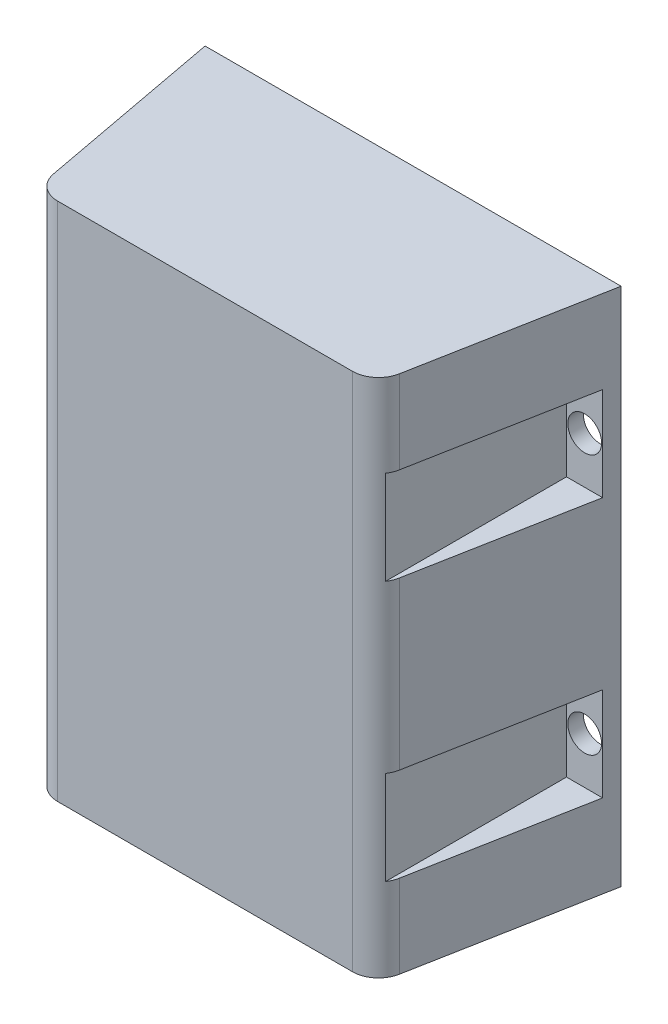
ISO-10303-21;
HEADER;
FILE_DESCRIPTION(('STEP AP214'),'2;1');
FILE_NAME('part.step','',(''),(''),'','','');
FILE_SCHEMA(('AUTOMOTIVE_DESIGN { 1 0 10303 214 1 1 1 1 }'));
ENDSEC;
DATA;
#1=APPLICATION_CONTEXT('core data for automotive mechanical design processes');
#2=APPLICATION_PROTOCOL_DEFINITION('international standard','automotive_design',2000,#1);
#3=PRODUCT_CONTEXT('',#1,'mechanical');
#4=PRODUCT('Part','Part','',(#3));
#5=PRODUCT_RELATED_PRODUCT_CATEGORY('part','',(#4));
#6=PRODUCT_DEFINITION_FORMATION('','',#4);
#7=PRODUCT_DEFINITION_CONTEXT('part definition',#1,'design');
#8=PRODUCT_DEFINITION('design','',#6,#7);
#9=PRODUCT_DEFINITION_SHAPE('','',#8);
#10=(LENGTH_UNIT() NAMED_UNIT(*) SI_UNIT(.MILLI.,.METRE.));
#11=(NAMED_UNIT(*) PLANE_ANGLE_UNIT() SI_UNIT($,.RADIAN.));
#12=(NAMED_UNIT(*) SI_UNIT($,.STERADIAN.) SOLID_ANGLE_UNIT());
#13=UNCERTAINTY_MEASURE_WITH_UNIT(LENGTH_MEASURE(1.E-05),#10,'distance_accuracy_value','');
#14=(GEOMETRIC_REPRESENTATION_CONTEXT(3) GLOBAL_UNCERTAINTY_ASSIGNED_CONTEXT((#13)) GLOBAL_UNIT_ASSIGNED_CONTEXT((#10,
#11,#12)) REPRESENTATION_CONTEXT('',''));
#15=CARTESIAN_POINT('',(0.,0.,0.));
#16=DIRECTION('',(0.,0.,1.));
#17=DIRECTION('',(1.,0.,0.));
#18=AXIS2_PLACEMENT_3D('',#15,#16,#17);
#19=CARTESIAN_POINT('',(-40.,50.,40.));
#20=DIRECTION('',(0.,-1.,0.));
#21=DIRECTION('',(0.,0.,-1.));
#22=AXIS2_PLACEMENT_3D('',#19,#20,#21);
#23=PLANE('',#22);
#24=CARTESIAN_POINT('',(28.3503685637188,50.,35.));
#25=DIRECTION('',(0.,-1.,0.));
#26=DIRECTION('',(0.,0.,-1.));
#27=AXIS2_PLACEMENT_3D('',#24,#25,#26);
#28=CIRCLE('',#27,5.);
#29=CARTESIAN_POINT('',(33.2647294983905,50.,35.9214426752509));
#30=VERTEX_POINT('',#29);
#31=CARTESIAN_POINT('',(28.3503685637188,50.,40.));
#32=VERTEX_POINT('',#31);
#33=EDGE_CURVE('E187',#30,#32,#28,.T.);
#34=ORIENTED_EDGE('',*,*,#33,.F.);
#35=DIRECTION('',(-0.184288535050185,0.,0.982872186934322));
#36=VECTOR('',#35,1.);
#37=CARTESIAN_POINT('',(32.5,50.,40.));
#38=LINE('',#37,#36);
#39=CARTESIAN_POINT('',(40.,50.,0.));
#40=VERTEX_POINT('',#39);
#41=EDGE_CURVE('E316',#40,#30,#38,.T.);
#42=ORIENTED_EDGE('',*,*,#41,.F.);
#43=DIRECTION('',(-1.,0.,0.));
#44=VECTOR('',#43,1.);
#45=CARTESIAN_POINT('',(-40.,50.,0.));
#46=LINE('',#45,#44);
#47=CARTESIAN_POINT('',(-40.,50.,0.));
#48=VERTEX_POINT('',#47);
#49=EDGE_CURVE('E226',#40,#48,#46,.T.);
#50=ORIENTED_EDGE('',*,*,#49,.T.);
#51=DIRECTION('',(-0.184288535050185,0.,-0.982872186934322));
#52=VECTOR('',#51,1.);
#53=CARTESIAN_POINT('',(-32.5,50.,40.));
#54=LINE('',#53,#52);
#55=CARTESIAN_POINT('',(-33.2647294983905,50.,35.9214426752509));
#56=VERTEX_POINT('',#55);
#57=EDGE_CURVE('E312',#56,#48,#54,.T.);
#58=ORIENTED_EDGE('',*,*,#57,.F.);
#59=CARTESIAN_POINT('',(-28.3503685637188,50.,35.));
#60=DIRECTION('',(0.,-1.,0.));
#61=DIRECTION('',(0.,0.,-1.));
#62=AXIS2_PLACEMENT_3D('',#59,#60,#61);
#63=CIRCLE('',#62,5.);
#64=CARTESIAN_POINT('',(-28.3503685637188,50.,40.));
#65=VERTEX_POINT('',#64);
#66=EDGE_CURVE('E198',#65,#56,#63,.T.);
#67=ORIENTED_EDGE('',*,*,#66,.F.);
#68=DIRECTION('',(-1.,0.,0.));
#69=VECTOR('',#68,1.);
#70=CARTESIAN_POINT('',(-40.,50.,40.));
#71=LINE('',#70,#69);
#72=EDGE_CURVE('E206',#32,#65,#71,.T.);
#73=ORIENTED_EDGE('',*,*,#72,.F.);
#74=EDGE_LOOP('',(#34,#42,#50,#58,#67,#73));
#75=FACE_BOUND('',#74,.T.);
#76=ADVANCED_FACE('F42',(#75),#23,.F.);
#77=CARTESIAN_POINT('',(-40.,-50.,40.));
#78=DIRECTION('',(0.,1.,0.));
#79=DIRECTION('',(0.,0.,1.));
#80=AXIS2_PLACEMENT_3D('',#77,#78,#79);
#81=PLANE('',#80);
#82=CARTESIAN_POINT('',(28.3503685637188,-50.,35.));
#83=DIRECTION('',(0.,-1.,0.));
#84=DIRECTION('',(0.,0.,-1.));
#85=AXIS2_PLACEMENT_3D('',#82,#83,#84);
#86=CIRCLE('',#85,5.);
#87=CARTESIAN_POINT('',(33.2647294983905,-50.,35.9214426752509));
#88=VERTEX_POINT('',#87);
#89=CARTESIAN_POINT('',(28.3503685637188,-50.,40.));
#90=VERTEX_POINT('',#89);
#91=EDGE_CURVE('E698',#88,#90,#86,.T.);
#92=ORIENTED_EDGE('',*,*,#91,.T.);
#93=DIRECTION('',(1.,0.,0.));
#94=VECTOR('',#93,1.);
#95=CARTESIAN_POINT('',(-40.,-50.,40.));
#96=LINE('',#95,#94);
#97=CARTESIAN_POINT('',(-28.3503685637188,-50.,40.));
#98=VERTEX_POINT('',#97);
#99=EDGE_CURVE('E208',#98,#90,#96,.T.);
#100=ORIENTED_EDGE('',*,*,#99,.F.);
#101=CARTESIAN_POINT('',(-28.3503685637188,-50.,35.));
#102=DIRECTION('',(0.,-1.,0.));
#103=DIRECTION('',(0.,0.,-1.));
#104=AXIS2_PLACEMENT_3D('',#101,#102,#103);
#105=CIRCLE('',#104,5.);
#106=CARTESIAN_POINT('',(-33.2647294983905,-50.,35.9214426752509));
#107=VERTEX_POINT('',#106);
#108=EDGE_CURVE('E199',#98,#107,#105,.T.);
#109=ORIENTED_EDGE('',*,*,#108,.T.);
#110=DIRECTION('',(0.184288535050185,0.,0.982872186934322));
#111=VECTOR('',#110,1.);
#112=CARTESIAN_POINT('',(-32.7547169811321,-50.,38.6415094339623));
#113=LINE('',#112,#111);
#114=CARTESIAN_POINT('',(-40.,-50.,0.));
#115=VERTEX_POINT('',#114);
#116=EDGE_CURVE('E317',#115,#107,#113,.T.);
#117=ORIENTED_EDGE('',*,*,#116,.F.);
#118=DIRECTION('',(1.,0.,0.));
#119=VECTOR('',#118,1.);
#120=CARTESIAN_POINT('',(-40.,-50.,0.));
#121=LINE('',#120,#119);
#122=CARTESIAN_POINT('',(40.,-50.,0.));
#123=VERTEX_POINT('',#122);
#124=EDGE_CURVE('E213',#115,#123,#121,.T.);
#125=ORIENTED_EDGE('',*,*,#124,.T.);
#126=DIRECTION('',(0.184288535050185,0.,-0.982872186934322));
#127=VECTOR('',#126,1.);
#128=CARTESIAN_POINT('',(30.0377358490566,-50.,53.1320754716981));
#129=LINE('',#128,#127);
#130=EDGE_CURVE('E221',#88,#123,#129,.T.);
#131=ORIENTED_EDGE('',*,*,#130,.F.);
#132=EDGE_LOOP('',(#92,#100,#109,#117,#125,#131));
#133=FACE_BOUND('',#132,.T.);
#134=ADVANCED_FACE('F331',(#133),#81,.F.);
#135=CARTESIAN_POINT('',(0.,0.,40.));
#136=DIRECTION('',(0.,0.,1.));
#137=DIRECTION('',(1.,0.,0.));
#138=AXIS2_PLACEMENT_3D('',#135,#136,#137);
#139=PLANE('',#138);
#140=DIRECTION('',(0.,-1.,0.));
#141=VECTOR('',#140,1.);
#142=CARTESIAN_POINT('',(28.3503685637188,50.,40.));
#143=LINE('',#142,#141);
#144=EDGE_CURVE('E190',#32,#90,#143,.T.);
#145=ORIENTED_EDGE('',*,*,#144,.F.);
#146=ORIENTED_EDGE('',*,*,#72,.T.);
#147=DIRECTION('',(0.,-1.,0.));
#148=VECTOR('',#147,1.);
#149=CARTESIAN_POINT('',(-28.3503685637188,50.,40.));
#150=LINE('',#149,#148);
#151=EDGE_CURVE('E209',#65,#98,#150,.T.);
#152=ORIENTED_EDGE('',*,*,#151,.T.);
#153=ORIENTED_EDGE('',*,*,#99,.T.);
#154=EDGE_LOOP('',(#145,#146,#152,#153));
#155=FACE_BOUND('',#154,.T.);
#156=ADVANCED_FACE('F204',(#155),#139,.T.);
#157=CARTESIAN_POINT('',(32.5,50.,40.));
#158=DIRECTION('',(0.982872186934322,0.,0.184288535050185));
#159=DIRECTION('',(0.184288535050185,0.,-0.982872186934322));
#160=AXIS2_PLACEMENT_3D('',#157,#158,#159);
#161=PLANE('',#160);
#162=ORIENTED_EDGE('',*,*,#41,.T.);
#163=DIRECTION('',(0.,-1.,0.));
#164=VECTOR('',#163,1.);
#165=CARTESIAN_POINT('',(33.2647294983905,50.,35.9214426752509));
#166=LINE('',#165,#164);
#167=CARTESIAN_POINT('',(33.2647294983905,34.,35.9214426752509));
#168=VERTEX_POINT('',#167);
#169=EDGE_CURVE('E193',#30,#168,#166,.T.);
#170=ORIENTED_EDGE('',*,*,#169,.T.);
#171=DIRECTION('',(-0.184288535050185,0.,0.982872186934322));
#172=VECTOR('',#171,1.);
#173=CARTESIAN_POINT('',(32.5,34.,40.));
#174=LINE('',#173,#172);
#175=CARTESIAN_POINT('',(39.4375,34.,3.));
#176=VERTEX_POINT('',#175);
#177=EDGE_CURVE('E232',#176,#168,#174,.T.);
#178=ORIENTED_EDGE('',*,*,#177,.F.);
#179=DIRECTION('',(0.,-1.,0.));
#180=VECTOR('',#179,1.);
#181=CARTESIAN_POINT('',(39.4375,50.,3.));
#182=LINE('',#181,#180);
#183=CARTESIAN_POINT('',(39.4375,16.,3.));
#184=VERTEX_POINT('',#183);
#185=EDGE_CURVE('E215',#176,#184,#182,.T.);
#186=ORIENTED_EDGE('',*,*,#185,.T.);
#187=DIRECTION('',(0.184288535050185,0.,-0.982872186934322));
#188=VECTOR('',#187,1.);
#189=CARTESIAN_POINT('',(32.5,16.,40.));
#190=LINE('',#189,#188);
#191=CARTESIAN_POINT('',(33.2647294983905,16.,35.9214426752509));
#192=VERTEX_POINT('',#191);
#193=EDGE_CURVE('E235',#192,#184,#190,.T.);
#194=ORIENTED_EDGE('',*,*,#193,.F.);
#195=CARTESIAN_POINT('',(33.2647294983905,-16.,35.9214426752509));
#196=VERTEX_POINT('',#195);
#197=EDGE_CURVE('E338',#192,#196,#166,.T.);
#198=ORIENTED_EDGE('',*,*,#197,.T.);
#199=DIRECTION('',(-0.184288535050185,0.,0.982872186934322));
#200=VECTOR('',#199,1.);
#201=CARTESIAN_POINT('',(32.5,-16.,40.));
#202=LINE('',#201,#200);
#203=CARTESIAN_POINT('',(39.4375,-16.,3.));
#204=VERTEX_POINT('',#203);
#205=EDGE_CURVE('E241',#204,#196,#202,.T.);
#206=ORIENTED_EDGE('',*,*,#205,.F.);
#207=DIRECTION('',(0.,1.,0.));
#208=VECTOR('',#207,1.);
#209=CARTESIAN_POINT('',(39.4375,50.,3.));
#210=LINE('',#209,#208);
#211=CARTESIAN_POINT('',(39.4375,-34.,3.));
#212=VERTEX_POINT('',#211);
#213=EDGE_CURVE('E237',#212,#204,#210,.T.);
#214=ORIENTED_EDGE('',*,*,#213,.F.);
#215=DIRECTION('',(0.184288535050185,0.,-0.982872186934322));
#216=VECTOR('',#215,1.);
#217=CARTESIAN_POINT('',(32.5,-34.,40.));
#218=LINE('',#217,#216);
#219=CARTESIAN_POINT('',(33.2647294983905,-34.,35.9214426752509));
#220=VERTEX_POINT('',#219);
#221=EDGE_CURVE('E239',#220,#212,#218,.T.);
#222=ORIENTED_EDGE('',*,*,#221,.F.);
#223=EDGE_CURVE('E328',#220,#88,#166,.T.);
#224=ORIENTED_EDGE('',*,*,#223,.T.);
#225=ORIENTED_EDGE('',*,*,#130,.T.);
#226=DIRECTION('',(0.,1.,0.));
#227=VECTOR('',#226,1.);
#228=CARTESIAN_POINT('',(40.,50.,0.));
#229=LINE('',#228,#227);
#230=EDGE_CURVE('E224',#123,#40,#229,.T.);
#231=ORIENTED_EDGE('',*,*,#230,.T.);
#232=EDGE_LOOP('',(#162,#170,#178,#186,#194,#198,#206,#214,#222,#224,#225,#231));
#233=FACE_BOUND('',#232,.T.);
#234=ADVANCED_FACE('F325',(#233),#161,.T.);
#235=CARTESIAN_POINT('',(32.5,16.,3.));
#236=DIRECTION('',(0.,-1.,0.));
#237=DIRECTION('',(0.,0.,-1.));
#238=AXIS2_PLACEMENT_3D('',#235,#236,#237);
#239=PLANE('',#238);
#240=CARTESIAN_POINT('',(28.3503685637188,16.,35.));
#241=DIRECTION('',(0.,-1.,0.));
#242=DIRECTION('',(0.,0.,-1.));
#243=AXIS2_PLACEMENT_3D('',#240,#241,#242);
#244=CIRCLE('',#243,5.);
#245=CARTESIAN_POINT('',(32.5,16.,37.7893653297886));
#246=VERTEX_POINT('',#245);
#247=EDGE_CURVE('E396',#192,#246,#244,.T.);
#248=ORIENTED_EDGE('',*,*,#247,.F.);
#249=ORIENTED_EDGE('',*,*,#193,.T.);
#250=DIRECTION('',(1.,0.,0.));
#251=VECTOR('',#250,1.);
#252=CARTESIAN_POINT('',(32.5,16.,3.));
#253=LINE('',#252,#251);
#254=CARTESIAN_POINT('',(32.5,16.,3.));
#255=VERTEX_POINT('',#254);
#256=EDGE_CURVE('E355',#255,#184,#253,.T.);
#257=ORIENTED_EDGE('',*,*,#256,.F.);
#258=DIRECTION('',(0.,0.,1.));
#259=VECTOR('',#258,1.);
#260=CARTESIAN_POINT('',(32.5,16.,3.));
#261=LINE('',#260,#259);
#262=EDGE_CURVE('E288',#255,#246,#261,.T.);
#263=ORIENTED_EDGE('',*,*,#262,.T.);
#264=EDGE_LOOP('',(#248,#249,#257,#263));
#265=FACE_BOUND('',#264,.T.);
#266=ADVANCED_FACE('F452',(#265),#239,.F.);
#267=CARTESIAN_POINT('',(32.5,34.,3.));
#268=DIRECTION('',(-1.,0.,0.));
#269=DIRECTION('',(0.,-1.,0.));
#270=AXIS2_PLACEMENT_3D('',#267,#268,#269);
#271=PLANE('',#270);
#272=DIRECTION('',(0.,-1.,0.));
#273=VECTOR('',#272,1.);
#274=CARTESIAN_POINT('',(32.5,50.,37.7893653297886));
#275=LINE('',#274,#273);
#276=CARTESIAN_POINT('',(32.5,34.,37.7893653297887));
#277=VERTEX_POINT('',#276);
#278=EDGE_CURVE('E394',#246,#277,#275,.F.);
#279=ORIENTED_EDGE('',*,*,#278,.F.);
#280=ORIENTED_EDGE('',*,*,#262,.F.);
#281=DIRECTION('',(0.,-1.,0.));
#282=VECTOR('',#281,1.);
#283=CARTESIAN_POINT('',(32.5,34.,3.));
#284=LINE('',#283,#282);
#285=CARTESIAN_POINT('',(32.5,34.,3.));
#286=VERTEX_POINT('',#285);
#287=EDGE_CURVE('E352',#286,#255,#284,.T.);
#288=ORIENTED_EDGE('',*,*,#287,.F.);
#289=DIRECTION('',(0.,0.,1.));
#290=VECTOR('',#289,1.);
#291=CARTESIAN_POINT('',(32.5,34.,3.));
#292=LINE('',#291,#290);
#293=EDGE_CURVE('E348',#286,#277,#292,.T.);
#294=ORIENTED_EDGE('',*,*,#293,.T.);
#295=EDGE_LOOP('',(#279,#280,#288,#294));
#296=FACE_BOUND('',#295,.T.);
#297=ADVANCED_FACE('F498',(#296),#271,.F.);
#298=CARTESIAN_POINT('',(40.,34.,3.));
#299=DIRECTION('',(0.,1.,0.));
#300=DIRECTION('',(0.,0.,1.));
#301=AXIS2_PLACEMENT_3D('',#298,#299,#300);
#302=PLANE('',#301);
#303=CARTESIAN_POINT('',(28.3503685637188,34.,35.));
#304=DIRECTION('',(0.,1.,0.));
#305=DIRECTION('',(0.,0.,1.));
#306=AXIS2_PLACEMENT_3D('',#303,#304,#305);
#307=CIRCLE('',#306,5.);
#308=EDGE_CURVE('E345',#277,#168,#307,.T.);
#309=ORIENTED_EDGE('',*,*,#308,.F.);
#310=ORIENTED_EDGE('',*,*,#293,.F.);
#311=DIRECTION('',(-1.,0.,0.));
#312=VECTOR('',#311,1.);
#313=CARTESIAN_POINT('',(40.,34.,3.));
#314=LINE('',#313,#312);
#315=EDGE_CURVE('E347',#176,#286,#314,.T.);
#316=ORIENTED_EDGE('',*,*,#315,.F.);
#317=ORIENTED_EDGE('',*,*,#177,.T.);
#318=EDGE_LOOP('',(#309,#310,#316,#317));
#319=FACE_BOUND('',#318,.T.);
#320=ADVANCED_FACE('F343',(#319),#302,.F.);
#321=CARTESIAN_POINT('',(32.5,-16.,3.));
#322=DIRECTION('',(0.,1.,0.));
#323=DIRECTION('',(0.,0.,1.));
#324=AXIS2_PLACEMENT_3D('',#321,#322,#323);
#325=PLANE('',#324);
#326=CARTESIAN_POINT('',(28.3503685637188,-16.,35.));
#327=DIRECTION('',(0.,1.,0.));
#328=DIRECTION('',(0.,0.,1.));
#329=AXIS2_PLACEMENT_3D('',#326,#327,#328);
#330=CIRCLE('',#329,5.);
#331=CARTESIAN_POINT('',(32.5,-16.,37.7893653297887));
#332=VERTEX_POINT('',#331);
#333=EDGE_CURVE('E391',#332,#196,#330,.T.);
#334=ORIENTED_EDGE('',*,*,#333,.F.);
#335=DIRECTION('',(0.,0.,1.));
#336=VECTOR('',#335,1.);
#337=CARTESIAN_POINT('',(32.5,-16.,3.));
#338=LINE('',#337,#336);
#339=CARTESIAN_POINT('',(32.5,-16.,3.));
#340=VERTEX_POINT('',#339);
#341=EDGE_CURVE('E294',#340,#332,#338,.T.);
#342=ORIENTED_EDGE('',*,*,#341,.F.);
#343=DIRECTION('',(-1.,0.,0.));
#344=VECTOR('',#343,1.);
#345=CARTESIAN_POINT('',(32.5,-16.,3.));
#346=LINE('',#345,#344);
#347=EDGE_CURVE('E285',#204,#340,#346,.T.);
#348=ORIENTED_EDGE('',*,*,#347,.F.);
#349=ORIENTED_EDGE('',*,*,#205,.T.);
#350=EDGE_LOOP('',(#334,#342,#348,#349));
#351=FACE_BOUND('',#350,.T.);
#352=ADVANCED_FACE('F471',(#351),#325,.F.);
#353=CARTESIAN_POINT('',(40.,-34.,3.));
#354=DIRECTION('',(0.,-1.,0.));
#355=DIRECTION('',(0.,0.,-1.));
#356=AXIS2_PLACEMENT_3D('',#353,#354,#355);
#357=PLANE('',#356);
#358=CARTESIAN_POINT('',(28.3503685637188,-34.,35.));
#359=DIRECTION('',(0.,-1.,0.));
#360=DIRECTION('',(0.,0.,-1.));
#361=AXIS2_PLACEMENT_3D('',#358,#359,#360);
#362=CIRCLE('',#361,5.);
#363=CARTESIAN_POINT('',(32.5,-34.,37.7893653297887));
#364=VERTEX_POINT('',#363);
#365=EDGE_CURVE('E55',#220,#364,#362,.T.);
#366=ORIENTED_EDGE('',*,*,#365,.F.);
#367=ORIENTED_EDGE('',*,*,#221,.T.);
#368=DIRECTION('',(1.,0.,0.));
#369=VECTOR('',#368,1.);
#370=CARTESIAN_POINT('',(40.,-34.,3.));
#371=LINE('',#370,#369);
#372=CARTESIAN_POINT('',(32.5,-34.,3.));
#373=VERTEX_POINT('',#372);
#374=EDGE_CURVE('E291',#373,#212,#371,.T.);
#375=ORIENTED_EDGE('',*,*,#374,.F.);
#376=DIRECTION('',(0.,0.,1.));
#377=VECTOR('',#376,1.);
#378=CARTESIAN_POINT('',(32.5,-34.,3.));
#379=LINE('',#378,#377);
#380=EDGE_CURVE('E295',#373,#364,#379,.T.);
#381=ORIENTED_EDGE('',*,*,#380,.T.);
#382=EDGE_LOOP('',(#366,#367,#375,#381));
#383=FACE_BOUND('',#382,.T.);
#384=ADVANCED_FACE('F474',(#383),#357,.F.);
#385=CARTESIAN_POINT('',(32.5,-34.,3.));
#386=DIRECTION('',(-1.,0.,0.));
#387=DIRECTION('',(0.,0.,1.));
#388=AXIS2_PLACEMENT_3D('',#385,#386,#387);
#389=PLANE('',#388);
#390=DIRECTION('',(0.,-1.,0.));
#391=VECTOR('',#390,1.);
#392=CARTESIAN_POINT('',(32.5,50.,37.7893653297887));
#393=LINE('',#392,#391);
#394=EDGE_CURVE('E12',#364,#332,#393,.F.);
#395=ORIENTED_EDGE('',*,*,#394,.F.);
#396=ORIENTED_EDGE('',*,*,#380,.F.);
#397=DIRECTION('',(0.,-1.,0.));
#398=VECTOR('',#397,1.);
#399=CARTESIAN_POINT('',(32.5,-34.,3.));
#400=LINE('',#399,#398);
#401=EDGE_CURVE('E287',#340,#373,#400,.T.);
#402=ORIENTED_EDGE('',*,*,#401,.F.);
#403=ORIENTED_EDGE('',*,*,#341,.T.);
#404=EDGE_LOOP('',(#395,#396,#402,#403));
#405=FACE_BOUND('',#404,.T.);
#406=ADVANCED_FACE('F457',(#405),#389,.F.);
#407=CARTESIAN_POINT('',(-40.,-34.,3.));
#408=DIRECTION('',(0.,-1.,0.));
#409=DIRECTION('',(0.,0.,-1.));
#410=AXIS2_PLACEMENT_3D('',#407,#408,#409);
#411=PLANE('',#410);
#412=CARTESIAN_POINT('',(-28.3503685637188,-34.,35.));
#413=DIRECTION('',(0.,-1.,0.));
#414=DIRECTION('',(0.,0.,-1.));
#415=AXIS2_PLACEMENT_3D('',#412,#413,#414);
#416=CIRCLE('',#415,5.);
#417=CARTESIAN_POINT('',(-32.5,-34.,37.7893653297887));
#418=VERTEX_POINT('',#417);
#419=CARTESIAN_POINT('',(-33.2647294983905,-34.,35.9214426752509));
#420=VERTEX_POINT('',#419);
#421=EDGE_CURVE('E388',#418,#420,#416,.T.);
#422=ORIENTED_EDGE('',*,*,#421,.F.);
#423=DIRECTION('',(0.,0.,1.));
#424=VECTOR('',#423,1.);
#425=CARTESIAN_POINT('',(-32.5,-34.,3.));
#426=LINE('',#425,#424);
#427=CARTESIAN_POINT('',(-32.5,-34.,3.));
#428=VERTEX_POINT('',#427);
#429=EDGE_CURVE('E308',#428,#418,#426,.T.);
#430=ORIENTED_EDGE('',*,*,#429,.F.);
#431=DIRECTION('',(1.,0.,0.));
#432=VECTOR('',#431,1.);
#433=CARTESIAN_POINT('',(-40.,-34.,3.));
#434=LINE('',#433,#432);
#435=CARTESIAN_POINT('',(-39.4375,-34.,3.));
#436=VERTEX_POINT('',#435);
#437=EDGE_CURVE('E280',#436,#428,#434,.T.);
#438=ORIENTED_EDGE('',*,*,#437,.F.);
#439=DIRECTION('',(0.184288535050185,0.,0.982872186934322));
#440=VECTOR('',#439,1.);
#441=CARTESIAN_POINT('',(-32.5,-34.,40.));
#442=LINE('',#441,#440);
#443=EDGE_CURVE('E249',#436,#420,#442,.T.);
#444=ORIENTED_EDGE('',*,*,#443,.T.);
#445=EDGE_LOOP('',(#422,#430,#438,#444));
#446=FACE_BOUND('',#445,.T.);
#447=ADVANCED_FACE('F453',(#446),#411,.F.);
#448=CARTESIAN_POINT('',(-32.5,-16.,3.));
#449=DIRECTION('',(0.,1.,0.));
#450=DIRECTION('',(0.,0.,1.));
#451=AXIS2_PLACEMENT_3D('',#448,#449,#450);
#452=PLANE('',#451);
#453=CARTESIAN_POINT('',(-28.3503685637188,-16.,35.));
#454=DIRECTION('',(0.,1.,0.));
#455=DIRECTION('',(0.,0.,1.));
#456=AXIS2_PLACEMENT_3D('',#453,#454,#455);
#457=CIRCLE('',#456,5.);
#458=CARTESIAN_POINT('',(-33.2647294983905,-16.,35.9214426752509));
#459=VERTEX_POINT('',#458);
#460=CARTESIAN_POINT('',(-32.5,-16.,37.7893653297887));
#461=VERTEX_POINT('',#460);
#462=EDGE_CURVE('E386',#459,#461,#457,.T.);
#463=ORIENTED_EDGE('',*,*,#462,.F.);
#464=DIRECTION('',(-0.184288535050185,0.,-0.982872186934322));
#465=VECTOR('',#464,1.);
#466=CARTESIAN_POINT('',(-32.5,-16.,40.));
#467=LINE('',#466,#465);
#468=CARTESIAN_POINT('',(-39.4375,-16.,3.));
#469=VERTEX_POINT('',#468);
#470=EDGE_CURVE('E247',#459,#469,#467,.T.);
#471=ORIENTED_EDGE('',*,*,#470,.T.);
#472=DIRECTION('',(-1.,0.,0.));
#473=VECTOR('',#472,1.);
#474=CARTESIAN_POINT('',(-32.5,-16.,3.));
#475=LINE('',#474,#473);
#476=CARTESIAN_POINT('',(-32.5,-16.,3.));
#477=VERTEX_POINT('',#476);
#478=EDGE_CURVE('E305',#477,#469,#475,.T.);
#479=ORIENTED_EDGE('',*,*,#478,.F.);
#480=DIRECTION('',(0.,0.,1.));
#481=VECTOR('',#480,1.);
#482=CARTESIAN_POINT('',(-32.5,-16.,3.));
#483=LINE('',#482,#481);
#484=EDGE_CURVE('E309',#477,#461,#483,.T.);
#485=ORIENTED_EDGE('',*,*,#484,.T.);
#486=EDGE_LOOP('',(#463,#471,#479,#485));
#487=FACE_BOUND('',#486,.T.);
#488=ADVANCED_FACE('F456',(#487),#452,.F.);
#489=CARTESIAN_POINT('',(-32.5,-34.,3.));
#490=DIRECTION('',(1.,0.,0.));
#491=DIRECTION('',(0.,0.,-1.));
#492=AXIS2_PLACEMENT_3D('',#489,#490,#491);
#493=PLANE('',#492);
#494=DIRECTION('',(0.,-1.,0.));
#495=VECTOR('',#494,1.);
#496=CARTESIAN_POINT('',(-32.5,50.,37.7893653297887));
#497=LINE('',#496,#495);
#498=EDGE_CURVE('E272',#461,#418,#497,.T.);
#499=ORIENTED_EDGE('',*,*,#498,.F.);
#500=ORIENTED_EDGE('',*,*,#484,.F.);
#501=DIRECTION('',(0.,1.,0.));
#502=VECTOR('',#501,1.);
#503=CARTESIAN_POINT('',(-32.5,-34.,3.));
#504=LINE('',#503,#502);
#505=EDGE_CURVE('E302',#428,#477,#504,.T.);
#506=ORIENTED_EDGE('',*,*,#505,.F.);
#507=ORIENTED_EDGE('',*,*,#429,.T.);
#508=EDGE_LOOP('',(#499,#500,#506,#507));
#509=FACE_BOUND('',#508,.T.);
#510=ADVANCED_FACE('F459',(#509),#493,.F.);
#511=CARTESIAN_POINT('',(-32.5,16.,3.));
#512=DIRECTION('',(0.,-1.,0.));
#513=DIRECTION('',(0.,0.,-1.));
#514=AXIS2_PLACEMENT_3D('',#511,#512,#513);
#515=PLANE('',#514);
#516=CARTESIAN_POINT('',(-28.3503685637188,16.,35.));
#517=DIRECTION('',(0.,-1.,0.));
#518=DIRECTION('',(0.,0.,-1.));
#519=AXIS2_PLACEMENT_3D('',#516,#517,#518);
#520=CIRCLE('',#519,5.);
#521=CARTESIAN_POINT('',(-32.5,16.,37.7893653297887));
#522=VERTEX_POINT('',#521);
#523=CARTESIAN_POINT('',(-33.2647294983905,16.,35.9214426752509));
#524=VERTEX_POINT('',#523);
#525=EDGE_CURVE('E260',#522,#524,#520,.T.);
#526=ORIENTED_EDGE('',*,*,#525,.F.);
#527=DIRECTION('',(0.,0.,1.));
#528=VECTOR('',#527,1.);
#529=CARTESIAN_POINT('',(-32.5,16.,3.));
#530=LINE('',#529,#528);
#531=CARTESIAN_POINT('',(-32.5,16.,3.));
#532=VERTEX_POINT('',#531);
#533=EDGE_CURVE('E269',#532,#522,#530,.T.);
#534=ORIENTED_EDGE('',*,*,#533,.F.);
#535=DIRECTION('',(1.,0.,0.));
#536=VECTOR('',#535,1.);
#537=CARTESIAN_POINT('',(-32.5,16.,3.));
#538=LINE('',#537,#536);
#539=CARTESIAN_POINT('',(-39.4375,16.,3.));
#540=VERTEX_POINT('',#539);
#541=EDGE_CURVE('E298',#540,#532,#538,.T.);
#542=ORIENTED_EDGE('',*,*,#541,.F.);
#543=DIRECTION('',(0.184288535050185,0.,0.982872186934322));
#544=VECTOR('',#543,1.);
#545=CARTESIAN_POINT('',(-32.5,16.,40.));
#546=LINE('',#545,#544);
#547=EDGE_CURVE('E256',#540,#524,#546,.T.);
#548=ORIENTED_EDGE('',*,*,#547,.T.);
#549=EDGE_LOOP('',(#526,#534,#542,#548));
#550=FACE_BOUND('',#549,.T.);
#551=ADVANCED_FACE('F267',(#550),#515,.F.);
#552=CARTESIAN_POINT('',(-40.,34.,3.));
#553=DIRECTION('',(0.,1.,0.));
#554=DIRECTION('',(0.,0.,1.));
#555=AXIS2_PLACEMENT_3D('',#552,#553,#554);
#556=PLANE('',#555);
#557=CARTESIAN_POINT('',(-28.3503685637188,34.,35.));
#558=DIRECTION('',(0.,1.,0.));
#559=DIRECTION('',(0.,0.,1.));
#560=AXIS2_PLACEMENT_3D('',#557,#558,#559);
#561=CIRCLE('',#560,5.);
#562=CARTESIAN_POINT('',(-33.2647294983905,34.,35.9214426752509));
#563=VERTEX_POINT('',#562);
#564=CARTESIAN_POINT('',(-32.5,34.,37.7893653297887));
#565=VERTEX_POINT('',#564);
#566=EDGE_CURVE('E63',#563,#565,#561,.T.);
#567=ORIENTED_EDGE('',*,*,#566,.F.);
#568=DIRECTION('',(-0.184288535050185,0.,-0.982872186934322));
#569=VECTOR('',#568,1.);
#570=CARTESIAN_POINT('',(-32.5,34.,40.));
#571=LINE('',#570,#569);
#572=CARTESIAN_POINT('',(-39.4375,34.,3.));
#573=VERTEX_POINT('',#572);
#574=EDGE_CURVE('E254',#563,#573,#571,.T.);
#575=ORIENTED_EDGE('',*,*,#574,.T.);
#576=DIRECTION('',(-1.,0.,0.));
#577=VECTOR('',#576,1.);
#578=CARTESIAN_POINT('',(-40.,34.,3.));
#579=LINE('',#578,#577);
#580=CARTESIAN_POINT('',(-32.5,34.,3.));
#581=VERTEX_POINT('',#580);
#582=EDGE_CURVE('E278',#581,#573,#579,.T.);
#583=ORIENTED_EDGE('',*,*,#582,.F.);
#584=DIRECTION('',(0.,0.,1.));
#585=VECTOR('',#584,1.);
#586=CARTESIAN_POINT('',(-32.5,34.,3.));
#587=LINE('',#586,#585);
#588=EDGE_CURVE('E277',#581,#565,#587,.T.);
#589=ORIENTED_EDGE('',*,*,#588,.T.);
#590=EDGE_LOOP('',(#567,#575,#583,#589));
#591=FACE_BOUND('',#590,.T.);
#592=ADVANCED_FACE('F487',(#591),#556,.F.);
#593=CARTESIAN_POINT('',(-32.5,34.,3.));
#594=DIRECTION('',(1.,0.,0.));
#595=DIRECTION('',(0.,1.,0.));
#596=AXIS2_PLACEMENT_3D('',#593,#594,#595);
#597=PLANE('',#596);
#598=DIRECTION('',(0.,-1.,0.));
#599=VECTOR('',#598,1.);
#600=CARTESIAN_POINT('',(-32.5,50.,37.7893653297887));
#601=LINE('',#600,#599);
#602=EDGE_CURVE('E49',#565,#522,#601,.T.);
#603=ORIENTED_EDGE('',*,*,#602,.F.);
#604=ORIENTED_EDGE('',*,*,#588,.F.);
#605=DIRECTION('',(0.,1.,0.));
#606=VECTOR('',#605,1.);
#607=CARTESIAN_POINT('',(-32.5,34.,3.));
#608=LINE('',#607,#606);
#609=EDGE_CURVE('E276',#532,#581,#608,.T.);
#610=ORIENTED_EDGE('',*,*,#609,.F.);
#611=ORIENTED_EDGE('',*,*,#533,.T.);
#612=EDGE_LOOP('',(#603,#604,#610,#611));
#613=FACE_BOUND('',#612,.T.);
#614=ADVANCED_FACE('F274',(#613),#597,.F.);
#615=CARTESIAN_POINT('',(0.,0.,0.));
#616=DIRECTION('',(0.,0.,1.));
#617=DIRECTION('',(1.,0.,0.));
#618=AXIS2_PLACEMENT_3D('',#615,#616,#617);
#619=PLANE('',#618);
#620=CARTESIAN_POINT('',(-36.,-25.,0.));
#621=DIRECTION('',(0.,0.,1.));
#622=DIRECTION('',(1.,0.,0.));
#623=AXIS2_PLACEMENT_3D('',#620,#621,#622);
#624=CIRCLE('',#623,3.24999999999999);
#625=CARTESIAN_POINT('',(-32.75,-25.,0.));
#626=VERTEX_POINT('',#625);
#627=EDGE_CURVE('E413',#626,#626,#624,.T.);
#628=ORIENTED_EDGE('',*,*,#627,.T.);
#629=EDGE_LOOP('',(#628));
#630=FACE_BOUND('',#629,.T.);
#631=CARTESIAN_POINT('',(36.,-25.,0.));
#632=DIRECTION('',(0.,0.,1.));
#633=DIRECTION('',(1.,0.,0.));
#634=AXIS2_PLACEMENT_3D('',#631,#632,#633);
#635=CIRCLE('',#634,3.24999999999999);
#636=CARTESIAN_POINT('',(39.25,-25.,0.));
#637=VERTEX_POINT('',#636);
#638=EDGE_CURVE('E358',#637,#637,#635,.T.);
#639=ORIENTED_EDGE('',*,*,#638,.T.);
#640=EDGE_LOOP('',(#639));
#641=FACE_BOUND('',#640,.T.);
#642=CARTESIAN_POINT('',(36.,25.,0.));
#643=DIRECTION('',(0.,0.,1.));
#644=DIRECTION('',(1.,0.,0.));
#645=AXIS2_PLACEMENT_3D('',#642,#643,#644);
#646=CIRCLE('',#645,3.24999999999999);
#647=CARTESIAN_POINT('',(39.25,25.,0.));
#648=VERTEX_POINT('',#647);
#649=EDGE_CURVE('E353',#648,#648,#646,.T.);
#650=ORIENTED_EDGE('',*,*,#649,.T.);
#651=EDGE_LOOP('',(#650));
#652=FACE_BOUND('',#651,.T.);
#653=CARTESIAN_POINT('',(-36.,25.,0.));
#654=DIRECTION('',(0.,0.,1.));
#655=DIRECTION('',(1.,0.,0.));
#656=AXIS2_PLACEMENT_3D('',#653,#654,#655);
#657=CIRCLE('',#656,3.24999999999999);
#658=CARTESIAN_POINT('',(-32.75,25.,0.));
#659=VERTEX_POINT('',#658);
#660=EDGE_CURVE('E410',#659,#659,#657,.T.);
#661=ORIENTED_EDGE('',*,*,#660,.T.);
#662=EDGE_LOOP('',(#661));
#663=FACE_BOUND('',#662,.T.);
#664=ORIENTED_EDGE('',*,*,#230,.F.);
#665=ORIENTED_EDGE('',*,*,#124,.F.);
#666=DIRECTION('',(0.,-1.,0.));
#667=VECTOR('',#666,1.);
#668=CARTESIAN_POINT('',(-40.,50.,0.));
#669=LINE('',#668,#667);
#670=EDGE_CURVE('E218',#48,#115,#669,.T.);
#671=ORIENTED_EDGE('',*,*,#670,.F.);
#672=ORIENTED_EDGE('',*,*,#49,.F.);
#673=EDGE_LOOP('',(#664,#665,#671,#672));
#674=FACE_BOUND('',#673,.T.);
#675=ADVANCED_FACE('F336',(#630,#641,#652,#663,#674),#619,.F.);
#676=CARTESIAN_POINT('',(-32.5,50.,40.));
#677=DIRECTION('',(-0.982872186934322,0.,0.184288535050185));
#678=DIRECTION('',(0.184288535050185,0.,0.982872186934322));
#679=AXIS2_PLACEMENT_3D('',#676,#677,#678);
#680=PLANE('',#679);
#681=DIRECTION('',(0.,-1.,0.));
#682=VECTOR('',#681,1.);
#683=CARTESIAN_POINT('',(-33.2647294983905,50.,35.9214426752509));
#684=LINE('',#683,#682);
#685=EDGE_CURVE('E378',#56,#563,#684,.T.);
#686=ORIENTED_EDGE('',*,*,#685,.F.);
#687=ORIENTED_EDGE('',*,*,#57,.T.);
#688=ORIENTED_EDGE('',*,*,#670,.T.);
#689=ORIENTED_EDGE('',*,*,#116,.T.);
#690=EDGE_CURVE('E379',#420,#107,#684,.T.);
#691=ORIENTED_EDGE('',*,*,#690,.F.);
#692=ORIENTED_EDGE('',*,*,#443,.F.);
#693=DIRECTION('',(0.,1.,0.));
#694=VECTOR('',#693,1.);
#695=CARTESIAN_POINT('',(-39.4375,50.,3.));
#696=LINE('',#695,#694);
#697=EDGE_CURVE('E244',#436,#469,#696,.T.);
#698=ORIENTED_EDGE('',*,*,#697,.T.);
#699=ORIENTED_EDGE('',*,*,#470,.F.);
#700=EDGE_CURVE('E376',#524,#459,#684,.T.);
#701=ORIENTED_EDGE('',*,*,#700,.F.);
#702=ORIENTED_EDGE('',*,*,#547,.F.);
#703=DIRECTION('',(0.,-1.,0.));
#704=VECTOR('',#703,1.);
#705=CARTESIAN_POINT('',(-39.4375,50.,3.));
#706=LINE('',#705,#704);
#707=EDGE_CURVE('E252',#573,#540,#706,.T.);
#708=ORIENTED_EDGE('',*,*,#707,.F.);
#709=ORIENTED_EDGE('',*,*,#574,.F.);
#710=EDGE_LOOP('',(#686,#687,#688,#689,#691,#692,#698,#699,#701,#702,#708,#709));
#711=FACE_BOUND('',#710,.T.);
#712=ADVANCED_FACE('F373',(#711),#680,.T.);
#713=CARTESIAN_POINT('',(0.,0.,3.));
#714=DIRECTION('',(0.,0.,1.));
#715=DIRECTION('',(1.,0.,0.));
#716=AXIS2_PLACEMENT_3D('',#713,#714,#715);
#717=PLANE('',#716);
#718=CARTESIAN_POINT('',(36.,25.,3.));
#719=DIRECTION('',(0.,0.,1.));
#720=DIRECTION('',(-1.,0.,0.));
#721=AXIS2_PLACEMENT_3D('',#718,#719,#720);
#722=CIRCLE('',#721,3.24999999999999);
#723=CARTESIAN_POINT('',(32.75,25.,3.));
#724=VERTEX_POINT('',#723);
#725=EDGE_CURVE('E399',#724,#724,#722,.T.);
#726=ORIENTED_EDGE('',*,*,#725,.F.);
#727=EDGE_LOOP('',(#726));
#728=FACE_BOUND('',#727,.T.);
#729=ORIENTED_EDGE('',*,*,#315,.T.);
#730=ORIENTED_EDGE('',*,*,#287,.T.);
#731=ORIENTED_EDGE('',*,*,#256,.T.);
#732=ORIENTED_EDGE('',*,*,#185,.F.);
#733=EDGE_LOOP('',(#729,#730,#731,#732));
#734=FACE_BOUND('',#733,.T.);
#735=ADVANCED_FACE('F449',(#728,#734),#717,.T.);
#736=CARTESIAN_POINT('',(0.,0.,3.));
#737=DIRECTION('',(0.,0.,-1.));
#738=DIRECTION('',(-1.,0.,0.));
#739=AXIS2_PLACEMENT_3D('',#736,#737,#738);
#740=PLANE('',#739);
#741=CARTESIAN_POINT('',(36.,-25.,3.));
#742=DIRECTION('',(0.,0.,1.));
#743=DIRECTION('',(1.,0.,0.));
#744=AXIS2_PLACEMENT_3D('',#741,#742,#743);
#745=CIRCLE('',#744,3.24999999999999);
#746=CARTESIAN_POINT('',(39.25,-25.,3.));
#747=VERTEX_POINT('',#746);
#748=EDGE_CURVE('E403',#747,#747,#745,.T.);
#749=ORIENTED_EDGE('',*,*,#748,.F.);
#750=EDGE_LOOP('',(#749));
#751=FACE_BOUND('',#750,.T.);
#752=ORIENTED_EDGE('',*,*,#213,.T.);
#753=ORIENTED_EDGE('',*,*,#347,.T.);
#754=ORIENTED_EDGE('',*,*,#401,.T.);
#755=ORIENTED_EDGE('',*,*,#374,.T.);
#756=EDGE_LOOP('',(#752,#753,#754,#755));
#757=FACE_BOUND('',#756,.T.);
#758=ADVANCED_FACE('F469',(#751,#757),#740,.F.);
#759=CARTESIAN_POINT('',(0.,0.,3.));
#760=DIRECTION('',(0.,0.,1.));
#761=DIRECTION('',(1.,0.,0.));
#762=AXIS2_PLACEMENT_3D('',#759,#760,#761);
#763=PLANE('',#762);
#764=CARTESIAN_POINT('',(-36.,-25.,3.));
#765=DIRECTION('',(0.,0.,1.));
#766=DIRECTION('',(-1.,0.,0.));
#767=AXIS2_PLACEMENT_3D('',#764,#765,#766);
#768=CIRCLE('',#767,3.24999999999999);
#769=CARTESIAN_POINT('',(-39.25,-25.,3.));
#770=VERTEX_POINT('',#769);
#771=EDGE_CURVE('E398',#770,#770,#768,.T.);
#772=ORIENTED_EDGE('',*,*,#771,.F.);
#773=EDGE_LOOP('',(#772));
#774=FACE_BOUND('',#773,.T.);
#775=ORIENTED_EDGE('',*,*,#437,.T.);
#776=ORIENTED_EDGE('',*,*,#505,.T.);
#777=ORIENTED_EDGE('',*,*,#478,.T.);
#778=ORIENTED_EDGE('',*,*,#697,.F.);
#779=EDGE_LOOP('',(#775,#776,#777,#778));
#780=FACE_BOUND('',#779,.T.);
#781=ADVANCED_FACE('F466',(#774,#780),#763,.T.);
#782=CARTESIAN_POINT('',(0.,0.,3.));
#783=DIRECTION('',(0.,0.,-1.));
#784=DIRECTION('',(-1.,0.,0.));
#785=AXIS2_PLACEMENT_3D('',#782,#783,#784);
#786=PLANE('',#785);
#787=CARTESIAN_POINT('',(-36.,25.,3.));
#788=DIRECTION('',(0.,0.,1.));
#789=DIRECTION('',(1.,0.,0.));
#790=AXIS2_PLACEMENT_3D('',#787,#788,#789);
#791=CIRCLE('',#790,3.24999999999999);
#792=CARTESIAN_POINT('',(-32.75,25.,3.));
#793=VERTEX_POINT('',#792);
#794=EDGE_CURVE('E402',#793,#793,#791,.T.);
#795=ORIENTED_EDGE('',*,*,#794,.F.);
#796=EDGE_LOOP('',(#795));
#797=FACE_BOUND('',#796,.T.);
#798=ORIENTED_EDGE('',*,*,#707,.T.);
#799=ORIENTED_EDGE('',*,*,#541,.T.);
#800=ORIENTED_EDGE('',*,*,#609,.T.);
#801=ORIENTED_EDGE('',*,*,#582,.T.);
#802=EDGE_LOOP('',(#798,#799,#800,#801));
#803=FACE_BOUND('',#802,.T.);
#804=ADVANCED_FACE('F369',(#797,#803),#786,.F.);
#805=CARTESIAN_POINT('',(-36.,25.,-34.));
#806=DIRECTION('',(0.,0.,1.));
#807=DIRECTION('',(1.,0.,0.));
#808=AXIS2_PLACEMENT_3D('',#805,#806,#807);
#809=CYLINDRICAL_SURFACE('',#808,3.24999999999999);
#810=ORIENTED_EDGE('',*,*,#794,.T.);
#811=EDGE_LOOP('',(#810));
#812=FACE_BOUND('',#811,.T.);
#813=ORIENTED_EDGE('',*,*,#660,.F.);
#814=EDGE_LOOP('',(#813));
#815=FACE_BOUND('',#814,.T.);
#816=ADVANCED_FACE('F432',(#812,#815),#809,.F.);
#817=CARTESIAN_POINT('',(-36.,-25.,-34.));
#818=DIRECTION('',(0.,0.,1.));
#819=DIRECTION('',(1.,0.,0.));
#820=AXIS2_PLACEMENT_3D('',#817,#818,#819);
#821=CYLINDRICAL_SURFACE('',#820,3.24999999999999);
#822=ORIENTED_EDGE('',*,*,#771,.T.);
#823=EDGE_LOOP('',(#822));
#824=FACE_BOUND('',#823,.T.);
#825=ORIENTED_EDGE('',*,*,#627,.F.);
#826=EDGE_LOOP('',(#825));
#827=FACE_BOUND('',#826,.T.);
#828=ADVANCED_FACE('F423',(#824,#827),#821,.F.);
#829=CARTESIAN_POINT('',(36.,-25.,-34.));
#830=DIRECTION('',(0.,0.,1.));
#831=DIRECTION('',(1.,0.,0.));
#832=AXIS2_PLACEMENT_3D('',#829,#830,#831);
#833=CYLINDRICAL_SURFACE('',#832,3.24999999999999);
#834=ORIENTED_EDGE('',*,*,#748,.T.);
#835=EDGE_LOOP('',(#834));
#836=FACE_BOUND('',#835,.T.);
#837=ORIENTED_EDGE('',*,*,#638,.F.);
#838=EDGE_LOOP('',(#837));
#839=FACE_BOUND('',#838,.T.);
#840=ADVANCED_FACE('F420',(#836,#839),#833,.F.);
#841=CARTESIAN_POINT('',(36.,25.,-34.));
#842=DIRECTION('',(0.,0.,1.));
#843=DIRECTION('',(1.,0.,0.));
#844=AXIS2_PLACEMENT_3D('',#841,#842,#843);
#845=CYLINDRICAL_SURFACE('',#844,3.24999999999999);
#846=ORIENTED_EDGE('',*,*,#725,.T.);
#847=EDGE_LOOP('',(#846));
#848=FACE_BOUND('',#847,.T.);
#849=ORIENTED_EDGE('',*,*,#649,.F.);
#850=EDGE_LOOP('',(#849));
#851=FACE_BOUND('',#850,.T.);
#852=ADVANCED_FACE('F422',(#848,#851),#845,.F.);
#853=CARTESIAN_POINT('',(-28.3503685637188,50.,35.));
#854=DIRECTION('',(0.,-1.,0.));
#855=DIRECTION('',(0.,0.,-1.));
#856=AXIS2_PLACEMENT_3D('',#853,#854,#855);
#857=CYLINDRICAL_SURFACE('',#856,5.);
#858=ORIENTED_EDGE('',*,*,#421,.T.);
#859=ORIENTED_EDGE('',*,*,#690,.T.);
#860=ORIENTED_EDGE('',*,*,#108,.F.);
#861=ORIENTED_EDGE('',*,*,#151,.F.);
#862=ORIENTED_EDGE('',*,*,#66,.T.);
#863=ORIENTED_EDGE('',*,*,#685,.T.);
#864=ORIENTED_EDGE('',*,*,#566,.T.);
#865=ORIENTED_EDGE('',*,*,#602,.T.);
#866=ORIENTED_EDGE('',*,*,#525,.T.);
#867=ORIENTED_EDGE('',*,*,#700,.T.);
#868=ORIENTED_EDGE('',*,*,#462,.T.);
#869=ORIENTED_EDGE('',*,*,#498,.T.);
#870=EDGE_LOOP('',(#858,#859,#860,#861,#862,#863,#864,#865,#866,#867,#868,#869));
#871=FACE_BOUND('',#870,.T.);
#872=ADVANCED_FACE('F259',(#871),#857,.T.);
#873=CARTESIAN_POINT('',(28.3503685637188,50.,35.));
#874=DIRECTION('',(0.,-1.,0.));
#875=DIRECTION('',(0.,0.,-1.));
#876=AXIS2_PLACEMENT_3D('',#873,#874,#875);
#877=CYLINDRICAL_SURFACE('',#876,5.);
#878=ORIENTED_EDGE('',*,*,#247,.T.);
#879=ORIENTED_EDGE('',*,*,#278,.T.);
#880=ORIENTED_EDGE('',*,*,#308,.T.);
#881=ORIENTED_EDGE('',*,*,#169,.F.);
#882=ORIENTED_EDGE('',*,*,#33,.T.);
#883=ORIENTED_EDGE('',*,*,#144,.T.);
#884=ORIENTED_EDGE('',*,*,#91,.F.);
#885=ORIENTED_EDGE('',*,*,#223,.F.);
#886=ORIENTED_EDGE('',*,*,#365,.T.);
#887=ORIENTED_EDGE('',*,*,#394,.T.);
#888=ORIENTED_EDGE('',*,*,#333,.T.);
#889=ORIENTED_EDGE('',*,*,#197,.F.);
#890=EDGE_LOOP('',(#878,#879,#880,#881,#882,#883,#884,#885,#886,#887,#888,#889));
#891=FACE_BOUND('',#890,.T.);
#892=ADVANCED_FACE('F189',(#891),#877,.T.);
#893=CLOSED_SHELL('',(#76,#134,#156,#234,#266,#297,#320,#352,#384,#406,#447,#488,#510,#551,#592,
#614,#675,#712,#735,#758,#781,#804,#816,#828,#840,#852,#872,#892));
#894=MANIFOLD_SOLID_BREP('B2',#893);
#895=ADVANCED_BREP_SHAPE_REPRESENTATION('',(#18,#894),#14);
#896=SHAPE_DEFINITION_REPRESENTATION(#9,#895);
ENDSEC;
END-ISO-10303-21;
